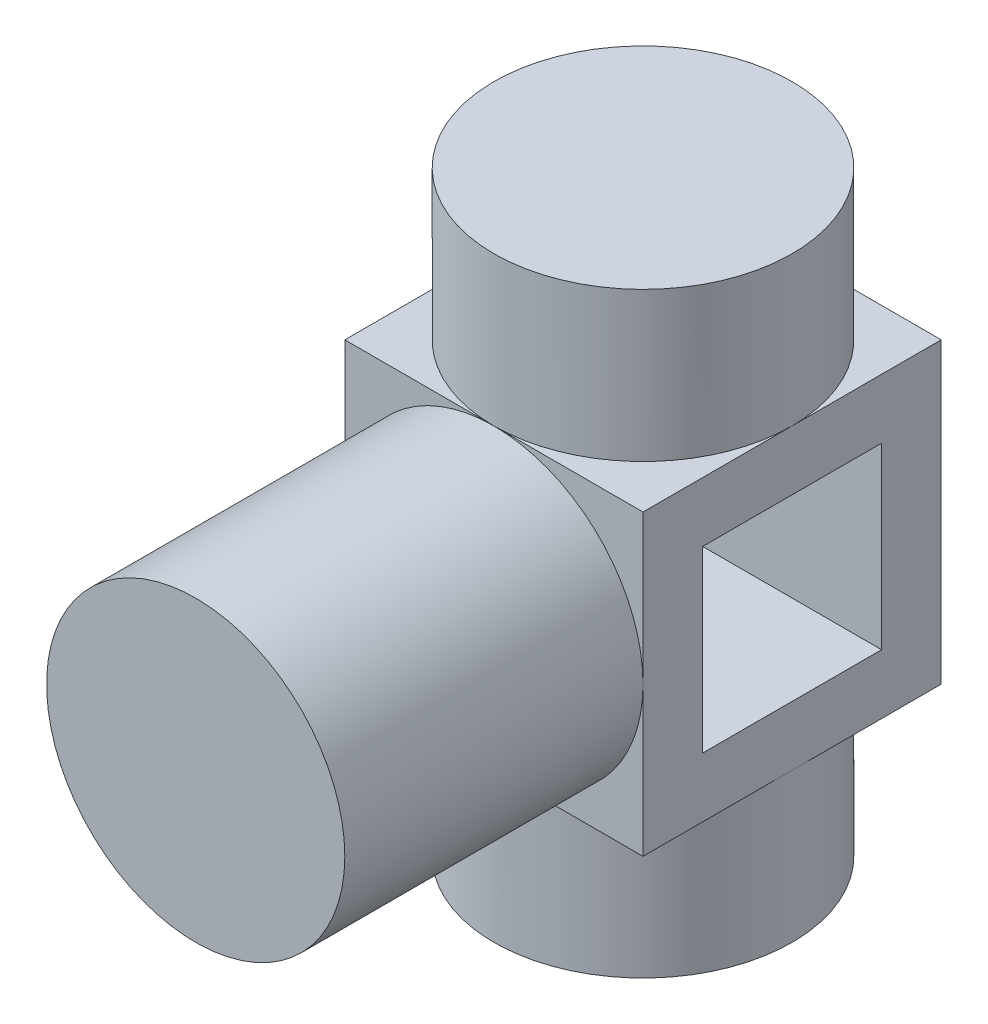
ISO-10303-21;
HEADER;
FILE_DESCRIPTION(('STEP AP214'),'2;1');
FILE_NAME('part.step','',(''),(''),'','','');
FILE_SCHEMA(('AUTOMOTIVE_DESIGN { 1 0 10303 214 1 1 1 1 }'));
ENDSEC;
DATA;
#1=APPLICATION_CONTEXT('core data for automotive mechanical design processes');
#2=APPLICATION_PROTOCOL_DEFINITION('international standard','automotive_design',2000,#1);
#3=PRODUCT_CONTEXT('',#1,'mechanical');
#4=PRODUCT('Part','Part','',(#3));
#5=PRODUCT_RELATED_PRODUCT_CATEGORY('part','',(#4));
#6=PRODUCT_DEFINITION_FORMATION('','',#4);
#7=PRODUCT_DEFINITION_CONTEXT('part definition',#1,'design');
#8=PRODUCT_DEFINITION('design','',#6,#7);
#9=PRODUCT_DEFINITION_SHAPE('','',#8);
#10=(LENGTH_UNIT() NAMED_UNIT(*) SI_UNIT(.MILLI.,.METRE.));
#11=(NAMED_UNIT(*) PLANE_ANGLE_UNIT() SI_UNIT($,.RADIAN.));
#12=(NAMED_UNIT(*) SI_UNIT($,.STERADIAN.) SOLID_ANGLE_UNIT());
#13=UNCERTAINTY_MEASURE_WITH_UNIT(LENGTH_MEASURE(1.E-05),#10,'distance_accuracy_value','');
#14=(GEOMETRIC_REPRESENTATION_CONTEXT(3) GLOBAL_UNCERTAINTY_ASSIGNED_CONTEXT((#13)) GLOBAL_UNIT_ASSIGNED_CONTEXT((#10,
#11,#12)) REPRESENTATION_CONTEXT('',''));
#15=CARTESIAN_POINT('',(0.,0.,0.));
#16=DIRECTION('',(0.,0.,1.));
#17=DIRECTION('',(1.,0.,0.));
#18=AXIS2_PLACEMENT_3D('',#15,#16,#17);
#19=CARTESIAN_POINT('',(0.,0.,0.));
#20=DIRECTION('',(0.,1.,0.));
#21=DIRECTION('',(0.,0.,1.));
#22=AXIS2_PLACEMENT_3D('',#19,#20,#21);
#23=PLANE('',#22);
#24=CARTESIAN_POINT('',(0.,0.,0.));
#25=DIRECTION('',(0.,-1.,0.));
#26=DIRECTION('',(0.,0.,-1.));
#27=AXIS2_PLACEMENT_3D('',#24,#25,#26);
#28=CIRCLE('',#27,25.);
#29=CARTESIAN_POINT('',(0.,0.,-25.));
#30=VERTEX_POINT('',#29);
#31=EDGE_CURVE('E274',#30,#30,#28,.T.);
#32=ORIENTED_EDGE('',*,*,#31,.T.);
#33=EDGE_LOOP('',(#32));
#34=FACE_BOUND('',#33,.T.);
#35=ADVANCED_FACE('F130',(#34),#23,.F.);
#36=CARTESIAN_POINT('',(-25.,100.,-25.));
#37=DIRECTION('',(1.,0.,0.));
#38=DIRECTION('',(0.,0.,-1.));
#39=AXIS2_PLACEMENT_3D('',#36,#37,#38);
#40=PLANE('',#39);
#41=DIRECTION('',(0.,0.,-1.));
#42=VECTOR('',#41,1.);
#43=CARTESIAN_POINT('',(-25.,65.,-15.));
#44=LINE('',#43,#42);
#45=CARTESIAN_POINT('',(-25.,65.,15.));
#46=VERTEX_POINT('',#45);
#47=CARTESIAN_POINT('',(-25.,65.,-15.));
#48=VERTEX_POINT('',#47);
#49=EDGE_CURVE('E246',#46,#48,#44,.T.);
#50=ORIENTED_EDGE('',*,*,#49,.F.);
#51=DIRECTION('',(0.,1.,0.));
#52=VECTOR('',#51,1.);
#53=CARTESIAN_POINT('',(-25.,65.,15.));
#54=LINE('',#53,#52);
#55=CARTESIAN_POINT('',(-25.,35.,15.));
#56=VERTEX_POINT('',#55);
#57=EDGE_CURVE('E145',#56,#46,#54,.T.);
#58=ORIENTED_EDGE('',*,*,#57,.F.);
#59=DIRECTION('',(0.,0.,1.));
#60=VECTOR('',#59,1.);
#61=CARTESIAN_POINT('',(-25.,35.,-15.));
#62=LINE('',#61,#60);
#63=CARTESIAN_POINT('',(-25.,35.,-15.));
#64=VERTEX_POINT('',#63);
#65=EDGE_CURVE('E233',#64,#56,#62,.T.);
#66=ORIENTED_EDGE('',*,*,#65,.F.);
#67=DIRECTION('',(0.,-1.,0.));
#68=VECTOR('',#67,1.);
#69=CARTESIAN_POINT('',(-25.,65.,-15.));
#70=LINE('',#69,#68);
#71=EDGE_CURVE('E252',#48,#64,#70,.T.);
#72=ORIENTED_EDGE('',*,*,#71,.F.);
#73=EDGE_LOOP('',(#50,#58,#66,#72));
#74=FACE_BOUND('',#73,.T.);
#75=DIRECTION('',(0.,0.,-1.));
#76=VECTOR('',#75,1.);
#77=CARTESIAN_POINT('',(-25.,25.,0.));
#78=LINE('',#77,#76);
#79=CARTESIAN_POINT('',(-25.,25.,0.));
#80=VERTEX_POINT('',#79);
#81=CARTESIAN_POINT('',(-25.,25.,-25.));
#82=VERTEX_POINT('',#81);
#83=EDGE_CURVE('E262',#80,#82,#78,.T.);
#84=ORIENTED_EDGE('',*,*,#83,.F.);
#85=DIRECTION('',(0.,0.,-1.));
#86=VECTOR('',#85,1.);
#87=CARTESIAN_POINT('',(-25.,25.,0.));
#88=LINE('',#87,#86);
#89=CARTESIAN_POINT('',(-25.,25.,25.));
#90=VERTEX_POINT('',#89);
#91=EDGE_CURVE('E290',#90,#80,#88,.T.);
#92=ORIENTED_EDGE('',*,*,#91,.F.);
#93=DIRECTION('',(0.,-1.,0.));
#94=VECTOR('',#93,1.);
#95=CARTESIAN_POINT('',(-25.,100.,25.));
#96=LINE('',#95,#94);
#97=CARTESIAN_POINT('',(-25.,50.,25.));
#98=VERTEX_POINT('',#97);
#99=EDGE_CURVE('E341',#98,#90,#96,.T.);
#100=ORIENTED_EDGE('',*,*,#99,.F.);
#101=CARTESIAN_POINT('',(-25.,75.,25.));
#102=VERTEX_POINT('',#101);
#103=EDGE_CURVE('E342',#102,#98,#96,.T.);
#104=ORIENTED_EDGE('',*,*,#103,.F.);
#105=DIRECTION('',(0.,0.,1.));
#106=VECTOR('',#105,1.);
#107=CARTESIAN_POINT('',(-25.,75.,0.));
#108=LINE('',#107,#106);
#109=CARTESIAN_POINT('',(-25.,75.,0.));
#110=VERTEX_POINT('',#109);
#111=EDGE_CURVE('E321',#110,#102,#108,.T.);
#112=ORIENTED_EDGE('',*,*,#111,.F.);
#113=DIRECTION('',(0.,0.,1.));
#114=VECTOR('',#113,1.);
#115=CARTESIAN_POINT('',(-25.,75.,0.));
#116=LINE('',#115,#114);
#117=CARTESIAN_POINT('',(-25.,75.,-25.));
#118=VERTEX_POINT('',#117);
#119=EDGE_CURVE('E304',#118,#110,#116,.T.);
#120=ORIENTED_EDGE('',*,*,#119,.F.);
#121=DIRECTION('',(0.,-1.,0.));
#122=VECTOR('',#121,1.);
#123=CARTESIAN_POINT('',(-25.,100.,-25.));
#124=LINE('',#123,#122);
#125=EDGE_CURVE('E138',#118,#82,#124,.T.);
#126=ORIENTED_EDGE('',*,*,#125,.T.);
#127=EDGE_LOOP('',(#84,#92,#100,#104,#112,#120,#126));
#128=FACE_BOUND('',#127,.T.);
#129=ADVANCED_FACE('F348',(#74,#128),#40,.F.);
#130=CARTESIAN_POINT('',(-25.,100.,-25.));
#131=DIRECTION('',(0.,0.,1.));
#132=DIRECTION('',(1.,0.,0.));
#133=AXIS2_PLACEMENT_3D('',#130,#131,#132);
#134=PLANE('',#133);
#135=DIRECTION('',(1.,0.,0.));
#136=VECTOR('',#135,1.);
#137=CARTESIAN_POINT('',(0.,25.,-25.));
#138=LINE('',#137,#136);
#139=CARTESIAN_POINT('',(0.,25.,-25.));
#140=VERTEX_POINT('',#139);
#141=EDGE_CURVE('E264',#82,#140,#138,.T.);
#142=ORIENTED_EDGE('',*,*,#141,.F.);
#143=ORIENTED_EDGE('',*,*,#125,.F.);
#144=DIRECTION('',(-1.,0.,0.));
#145=VECTOR('',#144,1.);
#146=CARTESIAN_POINT('',(0.,75.,-25.));
#147=LINE('',#146,#145);
#148=CARTESIAN_POINT('',(0.,75.,-25.));
#149=VERTEX_POINT('',#148);
#150=EDGE_CURVE('E302',#149,#118,#147,.T.);
#151=ORIENTED_EDGE('',*,*,#150,.F.);
#152=DIRECTION('',(-1.,0.,0.));
#153=VECTOR('',#152,1.);
#154=CARTESIAN_POINT('',(0.,75.,-25.));
#155=LINE('',#154,#153);
#156=CARTESIAN_POINT('',(25.,75.,-25.));
#157=VERTEX_POINT('',#156);
#158=EDGE_CURVE('E313',#157,#149,#155,.T.);
#159=ORIENTED_EDGE('',*,*,#158,.F.);
#160=DIRECTION('',(0.,-1.,0.));
#161=VECTOR('',#160,1.);
#162=CARTESIAN_POINT('',(25.,100.,-25.));
#163=LINE('',#162,#161);
#164=CARTESIAN_POINT('',(25.,25.,-25.));
#165=VERTEX_POINT('',#164);
#166=EDGE_CURVE('E12',#157,#165,#163,.T.);
#167=ORIENTED_EDGE('',*,*,#166,.T.);
#168=DIRECTION('',(1.,0.,0.));
#169=VECTOR('',#168,1.);
#170=CARTESIAN_POINT('',(0.,25.,-25.));
#171=LINE('',#170,#169);
#172=EDGE_CURVE('E278',#140,#165,#171,.T.);
#173=ORIENTED_EDGE('',*,*,#172,.F.);
#174=EDGE_LOOP('',(#142,#143,#151,#159,#167,#173));
#175=FACE_BOUND('',#174,.T.);
#176=ADVANCED_FACE('F354',(#175),#134,.F.);
#177=CARTESIAN_POINT('',(25.,100.,-25.));
#178=DIRECTION('',(-1.,0.,0.));
#179=DIRECTION('',(0.,0.,1.));
#180=AXIS2_PLACEMENT_3D('',#177,#178,#179);
#181=PLANE('',#180);
#182=DIRECTION('',(0.,0.,-1.));
#183=VECTOR('',#182,1.);
#184=CARTESIAN_POINT('',(25.,35.,-15.));
#185=LINE('',#184,#183);
#186=CARTESIAN_POINT('',(25.,35.,15.));
#187=VERTEX_POINT('',#186);
#188=CARTESIAN_POINT('',(25.,35.,-15.));
#189=VERTEX_POINT('',#188);
#190=EDGE_CURVE('E244',#187,#189,#185,.T.);
#191=ORIENTED_EDGE('',*,*,#190,.F.);
#192=DIRECTION('',(0.,-1.,0.));
#193=VECTOR('',#192,1.);
#194=CARTESIAN_POINT('',(25.,65.,15.));
#195=LINE('',#194,#193);
#196=CARTESIAN_POINT('',(25.,65.,15.));
#197=VERTEX_POINT('',#196);
#198=EDGE_CURVE('E227',#197,#187,#195,.T.);
#199=ORIENTED_EDGE('',*,*,#198,.F.);
#200=DIRECTION('',(0.,0.,1.));
#201=VECTOR('',#200,1.);
#202=CARTESIAN_POINT('',(25.,65.,-15.));
#203=LINE('',#202,#201);
#204=CARTESIAN_POINT('',(25.,65.,-15.));
#205=VERTEX_POINT('',#204);
#206=EDGE_CURVE('E236',#205,#197,#203,.T.);
#207=ORIENTED_EDGE('',*,*,#206,.F.);
#208=DIRECTION('',(0.,1.,0.));
#209=VECTOR('',#208,1.);
#210=CARTESIAN_POINT('',(25.,65.,-15.));
#211=LINE('',#210,#209);
#212=EDGE_CURVE('E153',#189,#205,#211,.T.);
#213=ORIENTED_EDGE('',*,*,#212,.F.);
#214=EDGE_LOOP('',(#191,#199,#207,#213));
#215=FACE_BOUND('',#214,.T.);
#216=DIRECTION('',(0.,0.,1.));
#217=VECTOR('',#216,1.);
#218=CARTESIAN_POINT('',(25.,25.,0.));
#219=LINE('',#218,#217);
#220=CARTESIAN_POINT('',(25.,25.,0.));
#221=VERTEX_POINT('',#220);
#222=CARTESIAN_POINT('',(25.,25.,25.));
#223=VERTEX_POINT('',#222);
#224=EDGE_CURVE('E269',#221,#223,#219,.T.);
#225=ORIENTED_EDGE('',*,*,#224,.F.);
#226=DIRECTION('',(0.,0.,1.));
#227=VECTOR('',#226,1.);
#228=CARTESIAN_POINT('',(25.,25.,0.));
#229=LINE('',#228,#227);
#230=EDGE_CURVE('E280',#165,#221,#229,.T.);
#231=ORIENTED_EDGE('',*,*,#230,.F.);
#232=ORIENTED_EDGE('',*,*,#166,.F.);
#233=DIRECTION('',(0.,0.,-1.));
#234=VECTOR('',#233,1.);
#235=CARTESIAN_POINT('',(25.,75.,0.));
#236=LINE('',#235,#234);
#237=CARTESIAN_POINT('',(25.,75.,0.));
#238=VERTEX_POINT('',#237);
#239=EDGE_CURVE('E311',#238,#157,#236,.T.);
#240=ORIENTED_EDGE('',*,*,#239,.F.);
#241=DIRECTION('',(0.,0.,-1.));
#242=VECTOR('',#241,1.);
#243=CARTESIAN_POINT('',(25.,75.,0.));
#244=LINE('',#243,#242);
#245=CARTESIAN_POINT('',(25.,75.,25.));
#246=VERTEX_POINT('',#245);
#247=EDGE_CURVE('E297',#246,#238,#244,.T.);
#248=ORIENTED_EDGE('',*,*,#247,.F.);
#249=DIRECTION('',(0.,-1.,0.));
#250=VECTOR('',#249,1.);
#251=CARTESIAN_POINT('',(25.,100.,25.));
#252=LINE('',#251,#250);
#253=CARTESIAN_POINT('',(25.,50.,25.));
#254=VERTEX_POINT('',#253);
#255=EDGE_CURVE('E338',#246,#254,#252,.T.);
#256=ORIENTED_EDGE('',*,*,#255,.T.);
#257=EDGE_CURVE('E337',#254,#223,#252,.T.);
#258=ORIENTED_EDGE('',*,*,#257,.T.);
#259=EDGE_LOOP('',(#225,#231,#232,#240,#248,#256,#258));
#260=FACE_BOUND('',#259,.T.);
#261=ADVANCED_FACE('F132',(#215,#260),#181,.F.);
#262=CARTESIAN_POINT('',(-25.,100.,25.));
#263=DIRECTION('',(0.,0.,-1.));
#264=DIRECTION('',(-1.,0.,0.));
#265=AXIS2_PLACEMENT_3D('',#262,#263,#264);
#266=PLANE('',#265);
#267=DIRECTION('',(-1.,0.,0.));
#268=VECTOR('',#267,1.);
#269=CARTESIAN_POINT('',(0.,25.,25.));
#270=LINE('',#269,#268);
#271=CARTESIAN_POINT('',(0.,25.,25.));
#272=VERTEX_POINT('',#271);
#273=EDGE_CURVE('E271',#223,#272,#270,.T.);
#274=ORIENTED_EDGE('',*,*,#273,.F.);
#275=ORIENTED_EDGE('',*,*,#257,.F.);
#276=CARTESIAN_POINT('',(0.,50.,25.));
#277=DIRECTION('',(0.,0.,1.));
#278=DIRECTION('',(1.,0.,0.));
#279=AXIS2_PLACEMENT_3D('',#276,#277,#278);
#280=CIRCLE('',#279,25.);
#281=EDGE_CURVE('E331',#272,#254,#280,.T.);
#282=ORIENTED_EDGE('',*,*,#281,.F.);
#283=EDGE_LOOP('',(#274,#275,#282));
#284=FACE_BOUND('',#283,.T.);
#285=ADVANCED_FACE('F416',(#284),#266,.F.);
#286=DIRECTION('',(-1.,0.,0.));
#287=VECTOR('',#286,1.);
#288=CARTESIAN_POINT('',(0.,25.,25.));
#289=LINE('',#288,#287);
#290=EDGE_CURVE('E288',#272,#90,#289,.T.);
#291=ORIENTED_EDGE('',*,*,#290,.F.);
#292=EDGE_CURVE('E327',#98,#272,#280,.T.);
#293=ORIENTED_EDGE('',*,*,#292,.F.);
#294=ORIENTED_EDGE('',*,*,#99,.T.);
#295=EDGE_LOOP('',(#291,#293,#294));
#296=FACE_BOUND('',#295,.T.);
#297=ADVANCED_FACE('F374',(#296),#266,.F.);
#298=CARTESIAN_POINT('',(0.,100.,0.));
#299=DIRECTION('',(0.,1.,0.));
#300=DIRECTION('',(0.,0.,1.));
#301=AXIS2_PLACEMENT_3D('',#298,#299,#300);
#302=PLANE('',#301);
#303=CARTESIAN_POINT('',(0.,100.,0.));
#304=DIRECTION('',(0.,1.,0.));
#305=DIRECTION('',(0.,0.,1.));
#306=AXIS2_PLACEMENT_3D('',#303,#304,#305);
#307=CIRCLE('',#306,25.);
#308=CARTESIAN_POINT('',(0.,100.,25.));
#309=VERTEX_POINT('',#308);
#310=EDGE_CURVE('E307',#309,#309,#307,.T.);
#311=ORIENTED_EDGE('',*,*,#310,.T.);
#312=EDGE_LOOP('',(#311));
#313=FACE_BOUND('',#312,.T.);
#314=ADVANCED_FACE('F414',(#313),#302,.T.);
#315=DIRECTION('',(1.,0.,0.));
#316=VECTOR('',#315,1.);
#317=CARTESIAN_POINT('',(0.,75.,25.));
#318=LINE('',#317,#316);
#319=CARTESIAN_POINT('',(0.,75.,25.));
#320=VERTEX_POINT('',#319);
#321=EDGE_CURVE('E295',#320,#246,#318,.T.);
#322=ORIENTED_EDGE('',*,*,#321,.F.);
#323=CARTESIAN_POINT('',(0.,50.,25.));
#324=DIRECTION('',(0.,0.,1.));
#325=DIRECTION('',(1.,0.,0.));
#326=AXIS2_PLACEMENT_3D('',#323,#324,#325);
#327=CIRCLE('',#326,25.);
#328=EDGE_CURVE('E334',#254,#320,#327,.T.);
#329=ORIENTED_EDGE('',*,*,#328,.F.);
#330=ORIENTED_EDGE('',*,*,#255,.F.);
#331=EDGE_LOOP('',(#322,#329,#330));
#332=FACE_BOUND('',#331,.T.);
#333=ADVANCED_FACE('F437',(#332),#266,.F.);
#334=DIRECTION('',(1.,0.,0.));
#335=VECTOR('',#334,1.);
#336=CARTESIAN_POINT('',(0.,75.,25.));
#337=LINE('',#336,#335);
#338=EDGE_CURVE('E323',#102,#320,#337,.T.);
#339=ORIENTED_EDGE('',*,*,#338,.F.);
#340=ORIENTED_EDGE('',*,*,#103,.T.);
#341=EDGE_CURVE('E330',#320,#98,#327,.T.);
#342=ORIENTED_EDGE('',*,*,#341,.F.);
#343=EDGE_LOOP('',(#339,#340,#342));
#344=FACE_BOUND('',#343,.T.);
#345=ADVANCED_FACE('F383',(#344),#266,.F.);
#346=CARTESIAN_POINT('',(0.,0.,75.));
#347=DIRECTION('',(0.,0.,1.));
#348=DIRECTION('',(1.,0.,0.));
#349=AXIS2_PLACEMENT_3D('',#346,#347,#348);
#350=PLANE('',#349);
#351=CARTESIAN_POINT('',(0.,50.,75.));
#352=DIRECTION('',(0.,0.,1.));
#353=DIRECTION('',(1.,0.,0.));
#354=AXIS2_PLACEMENT_3D('',#351,#352,#353);
#355=CIRCLE('',#354,25.);
#356=CARTESIAN_POINT('',(25.,50.,75.));
#357=VERTEX_POINT('',#356);
#358=EDGE_CURVE('E326',#357,#357,#355,.T.);
#359=ORIENTED_EDGE('',*,*,#358,.T.);
#360=EDGE_LOOP('',(#359));
#361=FACE_BOUND('',#360,.T.);
#362=ADVANCED_FACE('F457',(#361),#350,.T.);
#363=CARTESIAN_POINT('',(0.,50.,25.));
#364=DIRECTION('',(0.,0.,1.));
#365=DIRECTION('',(1.,0.,0.));
#366=AXIS2_PLACEMENT_3D('',#363,#364,#365);
#367=CYLINDRICAL_SURFACE('',#366,25.);
#368=ORIENTED_EDGE('',*,*,#358,.F.);
#369=EDGE_LOOP('',(#368));
#370=FACE_BOUND('',#369,.T.);
#371=ORIENTED_EDGE('',*,*,#328,.T.);
#372=ORIENTED_EDGE('',*,*,#341,.T.);
#373=ORIENTED_EDGE('',*,*,#292,.T.);
#374=ORIENTED_EDGE('',*,*,#281,.T.);
#375=EDGE_LOOP('',(#371,#372,#373,#374));
#376=FACE_BOUND('',#375,.T.);
#377=ADVANCED_FACE('F378',(#370,#376),#367,.T.);
#378=CARTESIAN_POINT('',(0.,75.,0.));
#379=DIRECTION('',(0.,1.,0.));
#380=DIRECTION('',(0.,0.,1.));
#381=AXIS2_PLACEMENT_3D('',#378,#379,#380);
#382=PLANE('',#381);
#383=CARTESIAN_POINT('',(0.,75.,0.));
#384=DIRECTION('',(0.,1.,0.));
#385=DIRECTION('',(0.,0.,1.));
#386=AXIS2_PLACEMENT_3D('',#383,#384,#385);
#387=CIRCLE('',#386,25.);
#388=EDGE_CURVE('E316',#110,#320,#387,.T.);
#389=ORIENTED_EDGE('',*,*,#388,.F.);
#390=ORIENTED_EDGE('',*,*,#111,.T.);
#391=ORIENTED_EDGE('',*,*,#338,.T.);
#392=EDGE_LOOP('',(#389,#390,#391));
#393=FACE_BOUND('',#392,.T.);
#394=ADVANCED_FACE('F386',(#393),#382,.T.);
#395=CARTESIAN_POINT('',(0.,75.,0.));
#396=DIRECTION('',(0.,1.,0.));
#397=DIRECTION('',(0.,0.,1.));
#398=AXIS2_PLACEMENT_3D('',#395,#396,#397);
#399=CYLINDRICAL_SURFACE('',#398,25.);
#400=ORIENTED_EDGE('',*,*,#310,.F.);
#401=EDGE_LOOP('',(#400));
#402=FACE_BOUND('',#401,.T.);
#403=CARTESIAN_POINT('',(0.,75.,0.));
#404=DIRECTION('',(0.,1.,0.));
#405=DIRECTION('',(0.,0.,1.));
#406=AXIS2_PLACEMENT_3D('',#403,#404,#405);
#407=CIRCLE('',#406,25.);
#408=EDGE_CURVE('E293',#320,#238,#407,.T.);
#409=ORIENTED_EDGE('',*,*,#408,.T.);
#410=CARTESIAN_POINT('',(0.,75.,0.));
#411=DIRECTION('',(0.,1.,0.));
#412=DIRECTION('',(0.,0.,1.));
#413=AXIS2_PLACEMENT_3D('',#410,#411,#412);
#414=CIRCLE('',#413,25.);
#415=EDGE_CURVE('E308',#238,#149,#414,.T.);
#416=ORIENTED_EDGE('',*,*,#415,.T.);
#417=CARTESIAN_POINT('',(0.,75.,0.));
#418=DIRECTION('',(0.,1.,0.));
#419=DIRECTION('',(0.,0.,1.));
#420=AXIS2_PLACEMENT_3D('',#417,#418,#419);
#421=CIRCLE('',#420,25.);
#422=EDGE_CURVE('E300',#149,#110,#421,.T.);
#423=ORIENTED_EDGE('',*,*,#422,.T.);
#424=ORIENTED_EDGE('',*,*,#388,.T.);
#425=EDGE_LOOP('',(#409,#416,#423,#424));
#426=FACE_BOUND('',#425,.T.);
#427=ADVANCED_FACE('F388',(#402,#426),#399,.T.);
#428=CARTESIAN_POINT('',(0.,75.,0.));
#429=DIRECTION('',(0.,1.,0.));
#430=DIRECTION('',(0.,0.,1.));
#431=AXIS2_PLACEMENT_3D('',#428,#429,#430);
#432=PLANE('',#431);
#433=ORIENTED_EDGE('',*,*,#415,.F.);
#434=ORIENTED_EDGE('',*,*,#239,.T.);
#435=ORIENTED_EDGE('',*,*,#158,.T.);
#436=EDGE_LOOP('',(#433,#434,#435));
#437=FACE_BOUND('',#436,.T.);
#438=ADVANCED_FACE('F394',(#437),#432,.T.);
#439=CARTESIAN_POINT('',(0.,75.,0.));
#440=DIRECTION('',(0.,1.,0.));
#441=DIRECTION('',(0.,0.,1.));
#442=AXIS2_PLACEMENT_3D('',#439,#440,#441);
#443=PLANE('',#442);
#444=ORIENTED_EDGE('',*,*,#422,.F.);
#445=ORIENTED_EDGE('',*,*,#150,.T.);
#446=ORIENTED_EDGE('',*,*,#119,.T.);
#447=EDGE_LOOP('',(#444,#445,#446));
#448=FACE_BOUND('',#447,.T.);
#449=ADVANCED_FACE('F391',(#448),#443,.T.);
#450=CARTESIAN_POINT('',(0.,75.,0.));
#451=DIRECTION('',(0.,1.,0.));
#452=DIRECTION('',(0.,0.,1.));
#453=AXIS2_PLACEMENT_3D('',#450,#451,#452);
#454=PLANE('',#453);
#455=ORIENTED_EDGE('',*,*,#408,.F.);
#456=ORIENTED_EDGE('',*,*,#321,.T.);
#457=ORIENTED_EDGE('',*,*,#247,.T.);
#458=EDGE_LOOP('',(#455,#456,#457));
#459=FACE_BOUND('',#458,.T.);
#460=ADVANCED_FACE('F393',(#459),#454,.T.);
#461=CARTESIAN_POINT('',(0.,25.,0.));
#462=DIRECTION('',(0.,-1.,0.));
#463=DIRECTION('',(0.,0.,-1.));
#464=AXIS2_PLACEMENT_3D('',#461,#462,#463);
#465=PLANE('',#464);
#466=CARTESIAN_POINT('',(0.,25.,0.));
#467=DIRECTION('',(0.,-1.,0.));
#468=DIRECTION('',(0.,0.,-1.));
#469=AXIS2_PLACEMENT_3D('',#466,#467,#468);
#470=CIRCLE('',#469,25.);
#471=EDGE_CURVE('E283',#272,#80,#470,.T.);
#472=ORIENTED_EDGE('',*,*,#471,.F.);
#473=ORIENTED_EDGE('',*,*,#290,.T.);
#474=ORIENTED_EDGE('',*,*,#91,.T.);
#475=EDGE_LOOP('',(#472,#473,#474));
#476=FACE_BOUND('',#475,.T.);
#477=ADVANCED_FACE('F368',(#476),#465,.T.);
#478=CARTESIAN_POINT('',(0.,25.,0.));
#479=DIRECTION('',(0.,-1.,0.));
#480=DIRECTION('',(0.,0.,-1.));
#481=AXIS2_PLACEMENT_3D('',#478,#479,#480);
#482=CYLINDRICAL_SURFACE('',#481,25.);
#483=ORIENTED_EDGE('',*,*,#31,.F.);
#484=EDGE_LOOP('',(#483));
#485=FACE_BOUND('',#484,.T.);
#486=CARTESIAN_POINT('',(0.,25.,0.));
#487=DIRECTION('',(0.,-1.,0.));
#488=DIRECTION('',(0.,0.,-1.));
#489=AXIS2_PLACEMENT_3D('',#486,#487,#488);
#490=CIRCLE('',#489,25.);
#491=EDGE_CURVE('E239',#80,#140,#490,.T.);
#492=ORIENTED_EDGE('',*,*,#491,.T.);
#493=CARTESIAN_POINT('',(0.,25.,0.));
#494=DIRECTION('',(0.,-1.,0.));
#495=DIRECTION('',(0.,0.,-1.));
#496=AXIS2_PLACEMENT_3D('',#493,#494,#495);
#497=CIRCLE('',#496,25.);
#498=EDGE_CURVE('E275',#140,#221,#497,.T.);
#499=ORIENTED_EDGE('',*,*,#498,.T.);
#500=CARTESIAN_POINT('',(0.,25.,0.));
#501=DIRECTION('',(0.,-1.,0.));
#502=DIRECTION('',(0.,0.,-1.));
#503=AXIS2_PLACEMENT_3D('',#500,#501,#502);
#504=CIRCLE('',#503,25.);
#505=EDGE_CURVE('E267',#221,#272,#504,.T.);
#506=ORIENTED_EDGE('',*,*,#505,.T.);
#507=ORIENTED_EDGE('',*,*,#471,.T.);
#508=EDGE_LOOP('',(#492,#499,#506,#507));
#509=FACE_BOUND('',#508,.T.);
#510=ADVANCED_FACE('F364',(#485,#509),#482,.T.);
#511=CARTESIAN_POINT('',(0.,25.,0.));
#512=DIRECTION('',(0.,-1.,0.));
#513=DIRECTION('',(0.,0.,-1.));
#514=AXIS2_PLACEMENT_3D('',#511,#512,#513);
#515=PLANE('',#514);
#516=ORIENTED_EDGE('',*,*,#498,.F.);
#517=ORIENTED_EDGE('',*,*,#172,.T.);
#518=ORIENTED_EDGE('',*,*,#230,.T.);
#519=EDGE_LOOP('',(#516,#517,#518));
#520=FACE_BOUND('',#519,.T.);
#521=ADVANCED_FACE('F361',(#520),#515,.T.);
#522=CARTESIAN_POINT('',(0.,25.,0.));
#523=DIRECTION('',(0.,-1.,0.));
#524=DIRECTION('',(0.,0.,-1.));
#525=AXIS2_PLACEMENT_3D('',#522,#523,#524);
#526=PLANE('',#525);
#527=ORIENTED_EDGE('',*,*,#505,.F.);
#528=ORIENTED_EDGE('',*,*,#224,.T.);
#529=ORIENTED_EDGE('',*,*,#273,.T.);
#530=EDGE_LOOP('',(#527,#528,#529));
#531=FACE_BOUND('',#530,.T.);
#532=ADVANCED_FACE('F552',(#531),#526,.T.);
#533=CARTESIAN_POINT('',(0.,25.,0.));
#534=DIRECTION('',(0.,-1.,0.));
#535=DIRECTION('',(0.,0.,-1.));
#536=AXIS2_PLACEMENT_3D('',#533,#534,#535);
#537=PLANE('',#536);
#538=ORIENTED_EDGE('',*,*,#491,.F.);
#539=ORIENTED_EDGE('',*,*,#83,.T.);
#540=ORIENTED_EDGE('',*,*,#141,.T.);
#541=EDGE_LOOP('',(#538,#539,#540));
#542=FACE_BOUND('',#541,.T.);
#543=ADVANCED_FACE('F359',(#542),#537,.T.);
#544=CARTESIAN_POINT('',(25.001,65.,15.));
#545=DIRECTION('',(0.,0.,1.));
#546=DIRECTION('',(0.,-1.,0.));
#547=AXIS2_PLACEMENT_3D('',#544,#545,#546);
#548=PLANE('',#547);
#549=ORIENTED_EDGE('',*,*,#198,.T.);
#550=DIRECTION('',(-1.,0.,0.));
#551=VECTOR('',#550,1.);
#552=CARTESIAN_POINT('',(25.001,35.,15.));
#553=LINE('',#552,#551);
#554=EDGE_CURVE('E240',#187,#56,#553,.T.);
#555=ORIENTED_EDGE('',*,*,#554,.T.);
#556=ORIENTED_EDGE('',*,*,#57,.T.);
#557=DIRECTION('',(-1.,0.,0.));
#558=VECTOR('',#557,1.);
#559=CARTESIAN_POINT('',(25.001,65.,15.));
#560=LINE('',#559,#558);
#561=EDGE_CURVE('E223',#197,#46,#560,.T.);
#562=ORIENTED_EDGE('',*,*,#561,.F.);
#563=EDGE_LOOP('',(#549,#555,#556,#562));
#564=FACE_BOUND('',#563,.T.);
#565=ADVANCED_FACE('F225',(#564),#548,.F.);
#566=CARTESIAN_POINT('',(25.001,35.,-15.));
#567=DIRECTION('',(0.,-1.,0.));
#568=DIRECTION('',(0.,0.,-1.));
#569=AXIS2_PLACEMENT_3D('',#566,#567,#568);
#570=PLANE('',#569);
#571=ORIENTED_EDGE('',*,*,#190,.T.);
#572=DIRECTION('',(-1.,0.,0.));
#573=VECTOR('',#572,1.);
#574=CARTESIAN_POINT('',(25.001,35.,-15.));
#575=LINE('',#574,#573);
#576=EDGE_CURVE('E258',#189,#64,#575,.T.);
#577=ORIENTED_EDGE('',*,*,#576,.T.);
#578=ORIENTED_EDGE('',*,*,#65,.T.);
#579=ORIENTED_EDGE('',*,*,#554,.F.);
#580=EDGE_LOOP('',(#571,#577,#578,#579));
#581=FACE_BOUND('',#580,.T.);
#582=ADVANCED_FACE('F578',(#581),#570,.F.);
#583=CARTESIAN_POINT('',(25.001,65.,-15.));
#584=DIRECTION('',(0.,0.,-1.));
#585=DIRECTION('',(0.,1.,0.));
#586=AXIS2_PLACEMENT_3D('',#583,#584,#585);
#587=PLANE('',#586);
#588=ORIENTED_EDGE('',*,*,#212,.T.);
#589=DIRECTION('',(-1.,0.,0.));
#590=VECTOR('',#589,1.);
#591=CARTESIAN_POINT('',(25.001,65.,-15.));
#592=LINE('',#591,#590);
#593=EDGE_CURVE('E232',#205,#48,#592,.T.);
#594=ORIENTED_EDGE('',*,*,#593,.T.);
#595=ORIENTED_EDGE('',*,*,#71,.T.);
#596=ORIENTED_EDGE('',*,*,#576,.F.);
#597=EDGE_LOOP('',(#588,#594,#595,#596));
#598=FACE_BOUND('',#597,.T.);
#599=ADVANCED_FACE('F586',(#598),#587,.F.);
#600=CARTESIAN_POINT('',(25.001,65.,-15.));
#601=DIRECTION('',(0.,1.,0.));
#602=DIRECTION('',(0.,0.,1.));
#603=AXIS2_PLACEMENT_3D('',#600,#601,#602);
#604=PLANE('',#603);
#605=ORIENTED_EDGE('',*,*,#206,.T.);
#606=ORIENTED_EDGE('',*,*,#561,.T.);
#607=ORIENTED_EDGE('',*,*,#49,.T.);
#608=ORIENTED_EDGE('',*,*,#593,.F.);
#609=EDGE_LOOP('',(#605,#606,#607,#608));
#610=FACE_BOUND('',#609,.T.);
#611=ADVANCED_FACE('F237',(#610),#604,.F.);
#612=CLOSED_SHELL('',(#35,#129,#176,#261,#285,#297,#314,#333,#345,#362,#377,#394,#427,#438,#449,
#460,#477,#510,#521,#532,#543,#565,#582,#599,#611));
#613=MANIFOLD_SOLID_BREP('B2',#612);
#614=ADVANCED_BREP_SHAPE_REPRESENTATION('',(#18,#613),#14);
#615=SHAPE_DEFINITION_REPRESENTATION(#9,#614);
ENDSEC;
END-ISO-10303-21;
